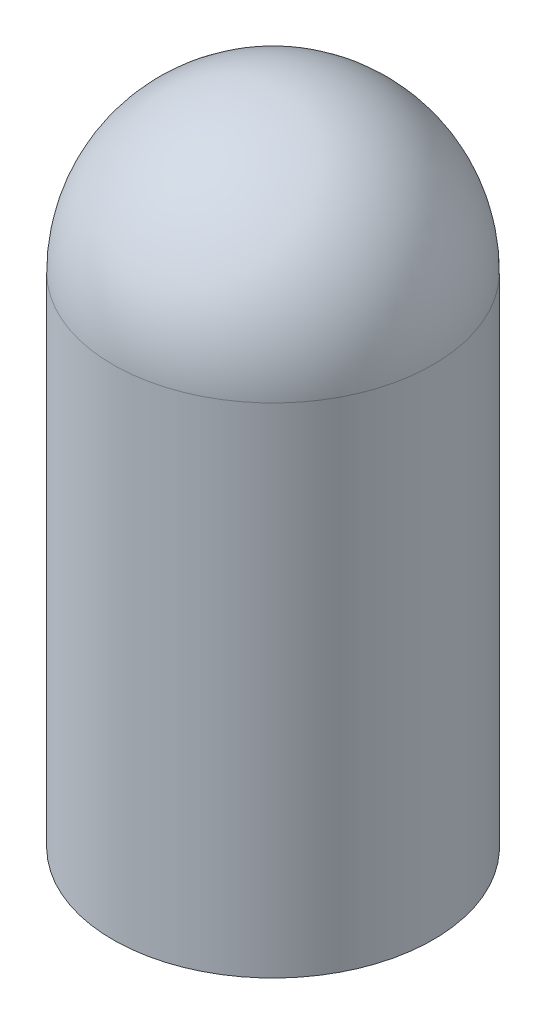
ISO-10303-21;
HEADER;
FILE_DESCRIPTION(('STEP AP214'),'2;1');
FILE_NAME('part.step','',(''),(''),'','','');
FILE_SCHEMA(('AUTOMOTIVE_DESIGN { 1 0 10303 214 1 1 1 1 }'));
ENDSEC;
DATA;
#1=APPLICATION_CONTEXT('core data for automotive mechanical design processes');
#2=APPLICATION_PROTOCOL_DEFINITION('international standard','automotive_design',2000,#1);
#3=PRODUCT_CONTEXT('',#1,'mechanical');
#4=PRODUCT('Part','Part','',(#3));
#5=PRODUCT_RELATED_PRODUCT_CATEGORY('part','',(#4));
#6=PRODUCT_DEFINITION_FORMATION('','',#4);
#7=PRODUCT_DEFINITION_CONTEXT('part definition',#1,'design');
#8=PRODUCT_DEFINITION('design','',#6,#7);
#9=PRODUCT_DEFINITION_SHAPE('','',#8);
#10=(LENGTH_UNIT() NAMED_UNIT(*) SI_UNIT(.MILLI.,.METRE.));
#11=(NAMED_UNIT(*) PLANE_ANGLE_UNIT() SI_UNIT($,.RADIAN.));
#12=(NAMED_UNIT(*) SI_UNIT($,.STERADIAN.) SOLID_ANGLE_UNIT());
#13=UNCERTAINTY_MEASURE_WITH_UNIT(LENGTH_MEASURE(1.E-05),#10,'distance_accuracy_value','');
#14=(GEOMETRIC_REPRESENTATION_CONTEXT(3) GLOBAL_UNCERTAINTY_ASSIGNED_CONTEXT((#13)) GLOBAL_UNIT_ASSIGNED_CONTEXT((#10,
#11,#12)) REPRESENTATION_CONTEXT('',''));
#15=CARTESIAN_POINT('',(0.,0.,0.));
#16=DIRECTION('',(0.,0.,1.));
#17=DIRECTION('',(1.,0.,0.));
#18=AXIS2_PLACEMENT_3D('',#15,#16,#17);
#19=CARTESIAN_POINT('',(0.,0.,0.));
#20=DIRECTION('',(0.,1.,0.));
#21=DIRECTION('',(-1.,0.,0.));
#22=AXIS2_PLACEMENT_3D('',#19,#20,#21);
#23=SPHERICAL_SURFACE('',#22,2.5);
#24=CARTESIAN_POINT('',(0.,0.,0.));
#25=DIRECTION('',(0.,1.,0.));
#26=DIRECTION('',(-1.,0.,0.));
#27=AXIS2_PLACEMENT_3D('',#24,#25,#26);
#28=CIRCLE('',#27,2.5);
#29=CARTESIAN_POINT('',(-2.5,0.,0.));
#30=VERTEX_POINT('',#29);
#31=EDGE_CURVE('E41',#30,#30,#28,.T.);
#32=ORIENTED_EDGE('',*,*,#31,.T.);
#33=EDGE_LOOP('',(#32));
#34=FACE_BOUND('',#33,.T.);
#35=ADVANCED_FACE('F35',(#34),#23,.T.);
#36=CARTESIAN_POINT('',(0.,-7.77777777777778,0.));
#37=DIRECTION('',(0.,1.,0.));
#38=DIRECTION('',(-1.,0.,0.));
#39=AXIS2_PLACEMENT_3D('',#36,#37,#38);
#40=PLANE('',#39);
#41=CARTESIAN_POINT('',(0.,-7.77777777777778,0.));
#42=DIRECTION('',(0.,1.,0.));
#43=DIRECTION('',(-1.,0.,0.));
#44=AXIS2_PLACEMENT_3D('',#41,#42,#43);
#45=CIRCLE('',#44,2.5);
#46=CARTESIAN_POINT('',(-2.5,-7.77777777777778,0.));
#47=VERTEX_POINT('',#46);
#48=EDGE_CURVE('E10',#47,#47,#45,.T.);
#49=ORIENTED_EDGE('',*,*,#48,.F.);
#50=EDGE_LOOP('',(#49));
#51=FACE_BOUND('',#50,.T.);
#52=ADVANCED_FACE('F50',(#51),#40,.F.);
#53=CARTESIAN_POINT('',(0.,2.5,0.));
#54=DIRECTION('',(0.,1.,0.));
#55=DIRECTION('',(-1.,0.,0.));
#56=AXIS2_PLACEMENT_3D('',#53,#54,#55);
#57=CYLINDRICAL_SURFACE('',#56,2.5);
#58=ORIENTED_EDGE('',*,*,#31,.F.);
#59=EDGE_LOOP('',(#58));
#60=FACE_BOUND('',#59,.T.);
#61=ORIENTED_EDGE('',*,*,#48,.T.);
#62=EDGE_LOOP('',(#61));
#63=FACE_BOUND('',#62,.T.);
#64=ADVANCED_FACE('F48',(#60,#63),#57,.T.);
#65=CLOSED_SHELL('',(#35,#52,#64));
#66=MANIFOLD_SOLID_BREP('B2',#65);
#67=ADVANCED_BREP_SHAPE_REPRESENTATION('',(#18,#66),#14);
#68=SHAPE_DEFINITION_REPRESENTATION(#9,#67);
ENDSEC;
END-ISO-10303-21;
